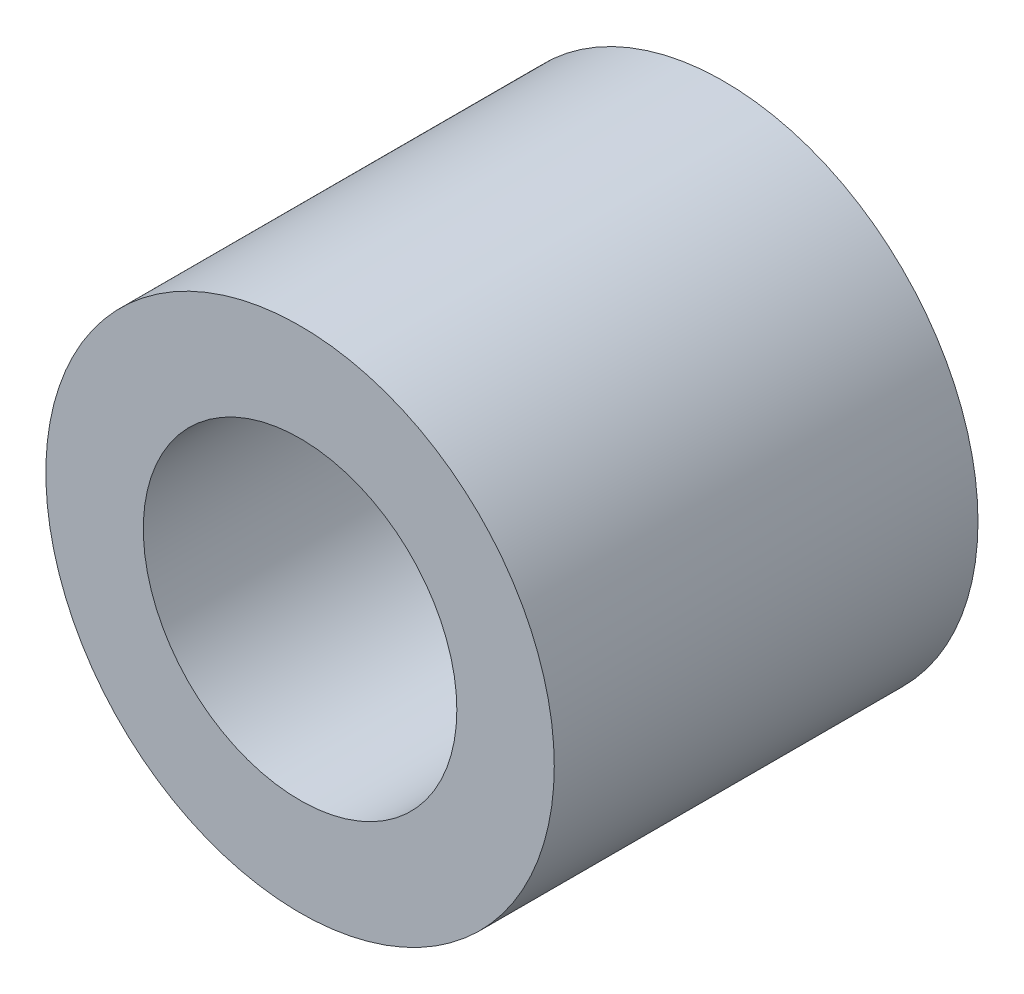
ISO-10303-21;
HEADER;
FILE_DESCRIPTION(('STEP AP214'),'2;1');
FILE_NAME('part.step','',(''),(''),'','','');
FILE_SCHEMA(('AUTOMOTIVE_DESIGN { 1 0 10303 214 1 1 1 1 }'));
ENDSEC;
DATA;
#1=APPLICATION_CONTEXT('core data for automotive mechanical design processes');
#2=APPLICATION_PROTOCOL_DEFINITION('international standard','automotive_design',2000,#1);
#3=PRODUCT_CONTEXT('',#1,'mechanical');
#4=PRODUCT('Part','Part','',(#3));
#5=PRODUCT_RELATED_PRODUCT_CATEGORY('part','',(#4));
#6=PRODUCT_DEFINITION_FORMATION('','',#4);
#7=PRODUCT_DEFINITION_CONTEXT('part definition',#1,'design');
#8=PRODUCT_DEFINITION('design','',#6,#7);
#9=PRODUCT_DEFINITION_SHAPE('','',#8);
#10=(LENGTH_UNIT() NAMED_UNIT(*) SI_UNIT(.MILLI.,.METRE.));
#11=(NAMED_UNIT(*) PLANE_ANGLE_UNIT() SI_UNIT($,.RADIAN.));
#12=(NAMED_UNIT(*) SI_UNIT($,.STERADIAN.) SOLID_ANGLE_UNIT());
#13=UNCERTAINTY_MEASURE_WITH_UNIT(LENGTH_MEASURE(1.E-05),#10,'distance_accuracy_value','');
#14=(GEOMETRIC_REPRESENTATION_CONTEXT(3) GLOBAL_UNCERTAINTY_ASSIGNED_CONTEXT((#13)) GLOBAL_UNIT_ASSIGNED_CONTEXT((#10,
#11,#12)) REPRESENTATION_CONTEXT('',''));
#15=CARTESIAN_POINT('',(0.,0.,0.));
#16=DIRECTION('',(0.,0.,1.));
#17=DIRECTION('',(1.,0.,0.));
#18=AXIS2_PLACEMENT_3D('',#15,#16,#17);
#19=CARTESIAN_POINT('',(0.,0.,5.));
#20=DIRECTION('',(0.,0.,1.));
#21=DIRECTION('',(1.,0.,0.));
#22=AXIS2_PLACEMENT_3D('',#19,#20,#21);
#23=PLANE('',#22);
#24=CARTESIAN_POINT('',(0.,0.,5.));
#25=DIRECTION('',(0.,0.,1.));
#26=DIRECTION('',(1.,0.,0.));
#27=AXIS2_PLACEMENT_3D('',#24,#25,#26);
#28=CIRCLE('',#27,3.);
#29=CARTESIAN_POINT('',(3.,0.,5.));
#30=VERTEX_POINT('',#29);
#31=EDGE_CURVE('E10',#30,#30,#28,.T.);
#32=ORIENTED_EDGE('',*,*,#31,.T.);
#33=EDGE_LOOP('',(#32));
#34=FACE_BOUND('',#33,.T.);
#35=CARTESIAN_POINT('',(0.,0.,5.));
#36=DIRECTION('',(0.,0.,1.));
#37=DIRECTION('',(1.,0.,0.));
#38=AXIS2_PLACEMENT_3D('',#35,#36,#37);
#39=CIRCLE('',#38,1.85);
#40=CARTESIAN_POINT('',(1.85,0.,5.));
#41=VERTEX_POINT('',#40);
#42=EDGE_CURVE('E42',#41,#41,#39,.T.);
#43=ORIENTED_EDGE('',*,*,#42,.F.);
#44=EDGE_LOOP('',(#43));
#45=FACE_BOUND('',#44,.T.);
#46=ADVANCED_FACE('F31',(#34,#45),#23,.T.);
#47=CARTESIAN_POINT('',(0.,0.,0.));
#48=DIRECTION('',(0.,0.,1.));
#49=DIRECTION('',(1.,0.,0.));
#50=AXIS2_PLACEMENT_3D('',#47,#48,#49);
#51=PLANE('',#50);
#52=CARTESIAN_POINT('',(0.,0.,0.));
#53=DIRECTION('',(0.,0.,1.));
#54=DIRECTION('',(1.,0.,0.));
#55=AXIS2_PLACEMENT_3D('',#52,#53,#54);
#56=CIRCLE('',#55,3.);
#57=CARTESIAN_POINT('',(3.,0.,0.));
#58=VERTEX_POINT('',#57);
#59=EDGE_CURVE('E35',#58,#58,#56,.T.);
#60=ORIENTED_EDGE('',*,*,#59,.F.);
#61=EDGE_LOOP('',(#60));
#62=FACE_BOUND('',#61,.T.);
#63=CARTESIAN_POINT('',(0.,0.,0.));
#64=DIRECTION('',(0.,0.,1.));
#65=DIRECTION('',(1.,0.,0.));
#66=AXIS2_PLACEMENT_3D('',#63,#64,#65);
#67=CIRCLE('',#66,1.85);
#68=CARTESIAN_POINT('',(1.85,0.,0.));
#69=VERTEX_POINT('',#68);
#70=EDGE_CURVE('E44',#69,#69,#67,.T.);
#71=ORIENTED_EDGE('',*,*,#70,.T.);
#72=EDGE_LOOP('',(#71));
#73=FACE_BOUND('',#72,.T.);
#74=ADVANCED_FACE('F54',(#62,#73),#51,.F.);
#75=CARTESIAN_POINT('',(0.,0.,5.));
#76=DIRECTION('',(0.,0.,-1.));
#77=DIRECTION('',(-1.,0.,0.));
#78=AXIS2_PLACEMENT_3D('',#75,#76,#77);
#79=CYLINDRICAL_SURFACE('',#78,3.);
#80=ORIENTED_EDGE('',*,*,#31,.F.);
#81=EDGE_LOOP('',(#80));
#82=FACE_BOUND('',#81,.T.);
#83=ORIENTED_EDGE('',*,*,#59,.T.);
#84=EDGE_LOOP('',(#83));
#85=FACE_BOUND('',#84,.T.);
#86=ADVANCED_FACE('F33',(#82,#85),#79,.T.);
#87=CARTESIAN_POINT('',(0.,0.,5.));
#88=DIRECTION('',(0.,0.,-1.));
#89=DIRECTION('',(-1.,0.,0.));
#90=AXIS2_PLACEMENT_3D('',#87,#88,#89);
#91=CYLINDRICAL_SURFACE('',#90,1.85);
#92=ORIENTED_EDGE('',*,*,#42,.T.);
#93=EDGE_LOOP('',(#92));
#94=FACE_BOUND('',#93,.T.);
#95=ORIENTED_EDGE('',*,*,#70,.F.);
#96=EDGE_LOOP('',(#95));
#97=FACE_BOUND('',#96,.T.);
#98=ADVANCED_FACE('F50',(#94,#97),#91,.F.);
#99=CLOSED_SHELL('',(#46,#74,#86,#98));
#100=MANIFOLD_SOLID_BREP('B2',#99);
#101=ADVANCED_BREP_SHAPE_REPRESENTATION('',(#18,#100),#14);
#102=SHAPE_DEFINITION_REPRESENTATION(#9,#101);
ENDSEC;
END-ISO-10303-21;
